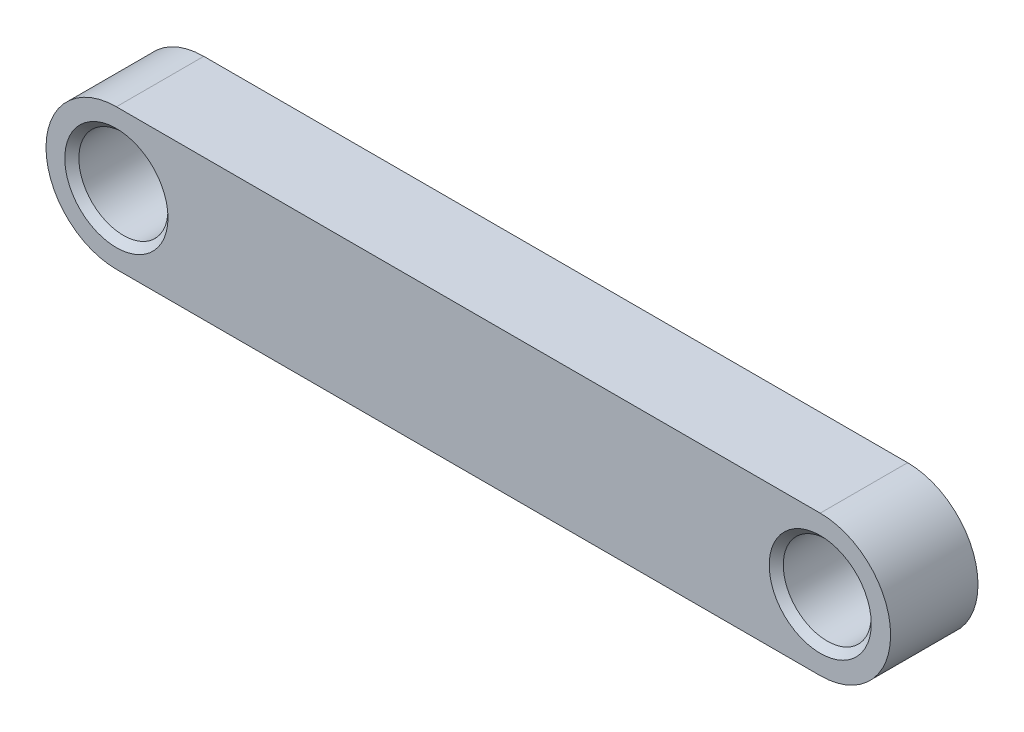
ISO-10303-21;
HEADER;
FILE_DESCRIPTION(('STEP AP214'),'2;1');
FILE_NAME('part.step','',(''),(''),'','','');
FILE_SCHEMA(('AUTOMOTIVE_DESIGN { 1 0 10303 214 1 1 1 1 }'));
ENDSEC;
DATA;
#1=APPLICATION_CONTEXT('core data for automotive mechanical design processes');
#2=APPLICATION_PROTOCOL_DEFINITION('international standard','automotive_design',2000,#1);
#3=PRODUCT_CONTEXT('',#1,'mechanical');
#4=PRODUCT('Part','Part','',(#3));
#5=PRODUCT_RELATED_PRODUCT_CATEGORY('part','',(#4));
#6=PRODUCT_DEFINITION_FORMATION('','',#4);
#7=PRODUCT_DEFINITION_CONTEXT('part definition',#1,'design');
#8=PRODUCT_DEFINITION('design','',#6,#7);
#9=PRODUCT_DEFINITION_SHAPE('','',#8);
#10=(LENGTH_UNIT() NAMED_UNIT(*) SI_UNIT(.MILLI.,.METRE.));
#11=(NAMED_UNIT(*) PLANE_ANGLE_UNIT() SI_UNIT($,.RADIAN.));
#12=(NAMED_UNIT(*) SI_UNIT($,.STERADIAN.) SOLID_ANGLE_UNIT());
#13=UNCERTAINTY_MEASURE_WITH_UNIT(LENGTH_MEASURE(1.E-05),#10,'distance_accuracy_value','');
#14=(GEOMETRIC_REPRESENTATION_CONTEXT(3) GLOBAL_UNCERTAINTY_ASSIGNED_CONTEXT((#13)) GLOBAL_UNIT_ASSIGNED_CONTEXT((#10,
#11,#12)) REPRESENTATION_CONTEXT('',''));
#15=CARTESIAN_POINT('',(0.,0.,0.));
#16=DIRECTION('',(0.,0.,1.));
#17=DIRECTION('',(1.,0.,0.));
#18=AXIS2_PLACEMENT_3D('',#15,#16,#17);
#19=CARTESIAN_POINT('',(-38.1,0.,9.4615));
#20=DIRECTION('',(0.,0.,-1.));
#21=DIRECTION('',(-1.,0.,0.));
#22=AXIS2_PLACEMENT_3D('',#19,#20,#21);
#23=CYLINDRICAL_SURFACE('',#22,7.62);
#24=CARTESIAN_POINT('',(-38.1,0.,0.));
#25=DIRECTION('',(0.,0.,1.));
#26=DIRECTION('',(1.,0.,0.));
#27=AXIS2_PLACEMENT_3D('',#24,#25,#26);
#28=CIRCLE('',#27,7.62);
#29=CARTESIAN_POINT('',(-38.1,7.62,0.));
#30=VERTEX_POINT('',#29);
#31=CARTESIAN_POINT('',(-38.1,-7.62,0.));
#32=VERTEX_POINT('',#31);
#33=EDGE_CURVE('E105',#30,#32,#28,.T.);
#34=ORIENTED_EDGE('',*,*,#33,.T.);
#35=DIRECTION('',(0.,0.,-1.));
#36=VECTOR('',#35,1.);
#37=CARTESIAN_POINT('',(-38.1,-7.62,9.4615));
#38=LINE('',#37,#36);
#39=CARTESIAN_POINT('',(-38.1,-7.62,9.4615));
#40=VERTEX_POINT('',#39);
#41=EDGE_CURVE('E96',#40,#32,#38,.T.);
#42=ORIENTED_EDGE('',*,*,#41,.F.);
#43=CARTESIAN_POINT('',(-38.1,0.,9.4615));
#44=DIRECTION('',(0.,0.,1.));
#45=DIRECTION('',(1.,0.,0.));
#46=AXIS2_PLACEMENT_3D('',#43,#44,#45);
#47=CIRCLE('',#46,7.62);
#48=CARTESIAN_POINT('',(-38.1,7.62,9.4615));
#49=VERTEX_POINT('',#48);
#50=EDGE_CURVE('E90',#49,#40,#47,.T.);
#51=ORIENTED_EDGE('',*,*,#50,.F.);
#52=DIRECTION('',(0.,0.,-1.));
#53=VECTOR('',#52,1.);
#54=CARTESIAN_POINT('',(-38.1,7.62,9.4615));
#55=LINE('',#54,#53);
#56=EDGE_CURVE('E101',#49,#30,#55,.T.);
#57=ORIENTED_EDGE('',*,*,#56,.T.);
#58=EDGE_LOOP('',(#34,#42,#51,#57));
#59=FACE_BOUND('',#58,.T.);
#60=ADVANCED_FACE('F37',(#59),#23,.T.);
#61=CARTESIAN_POINT('',(-38.1,-7.62,9.4615));
#62=DIRECTION('',(0.,1.,0.));
#63=DIRECTION('',(0.,0.,1.));
#64=AXIS2_PLACEMENT_3D('',#61,#62,#63);
#65=PLANE('',#64);
#66=DIRECTION('',(1.,0.,0.));
#67=VECTOR('',#66,1.);
#68=CARTESIAN_POINT('',(-38.1,-7.62,0.));
#69=LINE('',#68,#67);
#70=CARTESIAN_POINT('',(38.1,-7.62,0.));
#71=VERTEX_POINT('',#70);
#72=EDGE_CURVE('E95',#32,#71,#69,.T.);
#73=ORIENTED_EDGE('',*,*,#72,.T.);
#74=DIRECTION('',(0.,0.,-1.));
#75=VECTOR('',#74,1.);
#76=CARTESIAN_POINT('',(38.1,-7.62,9.4615));
#77=LINE('',#76,#75);
#78=CARTESIAN_POINT('',(38.1,-7.62,9.4615));
#79=VERTEX_POINT('',#78);
#80=EDGE_CURVE('E93',#79,#71,#77,.T.);
#81=ORIENTED_EDGE('',*,*,#80,.F.);
#82=DIRECTION('',(1.,0.,0.));
#83=VECTOR('',#82,1.);
#84=CARTESIAN_POINT('',(-38.1,-7.62,9.4615));
#85=LINE('',#84,#83);
#86=EDGE_CURVE('E85',#40,#79,#85,.T.);
#87=ORIENTED_EDGE('',*,*,#86,.F.);
#88=ORIENTED_EDGE('',*,*,#41,.T.);
#89=EDGE_LOOP('',(#73,#81,#87,#88));
#90=FACE_BOUND('',#89,.T.);
#91=ADVANCED_FACE('F94',(#90),#65,.F.);
#92=CARTESIAN_POINT('',(38.1,0.,9.4615));
#93=DIRECTION('',(0.,0.,-1.));
#94=DIRECTION('',(-1.,0.,0.));
#95=AXIS2_PLACEMENT_3D('',#92,#93,#94);
#96=CYLINDRICAL_SURFACE('',#95,7.62);
#97=CARTESIAN_POINT('',(38.1,0.,0.));
#98=DIRECTION('',(0.,0.,1.));
#99=DIRECTION('',(1.,0.,0.));
#100=AXIS2_PLACEMENT_3D('',#97,#98,#99);
#101=CIRCLE('',#100,7.62);
#102=CARTESIAN_POINT('',(38.1,7.62,0.));
#103=VERTEX_POINT('',#102);
#104=EDGE_CURVE('E71',#71,#103,#101,.T.);
#105=ORIENTED_EDGE('',*,*,#104,.T.);
#106=DIRECTION('',(0.,0.,-1.));
#107=VECTOR('',#106,1.);
#108=CARTESIAN_POINT('',(38.1,7.62,9.4615));
#109=LINE('',#108,#107);
#110=CARTESIAN_POINT('',(38.1,7.62,9.4615));
#111=VERTEX_POINT('',#110);
#112=EDGE_CURVE('E97',#111,#103,#109,.T.);
#113=ORIENTED_EDGE('',*,*,#112,.F.);
#114=CARTESIAN_POINT('',(38.1,0.,9.4615));
#115=DIRECTION('',(0.,0.,1.));
#116=DIRECTION('',(1.,0.,0.));
#117=AXIS2_PLACEMENT_3D('',#114,#115,#116);
#118=CIRCLE('',#117,7.62);
#119=EDGE_CURVE('E88',#79,#111,#118,.T.);
#120=ORIENTED_EDGE('',*,*,#119,.F.);
#121=ORIENTED_EDGE('',*,*,#80,.T.);
#122=EDGE_LOOP('',(#105,#113,#120,#121));
#123=FACE_BOUND('',#122,.T.);
#124=ADVANCED_FACE('F99',(#123),#96,.T.);
#125=CARTESIAN_POINT('',(-38.1,7.62,9.4615));
#126=DIRECTION('',(0.,-1.,0.));
#127=DIRECTION('',(0.,0.,-1.));
#128=AXIS2_PLACEMENT_3D('',#125,#126,#127);
#129=PLANE('',#128);
#130=DIRECTION('',(-1.,0.,0.));
#131=VECTOR('',#130,1.);
#132=CARTESIAN_POINT('',(-38.1,7.62,0.));
#133=LINE('',#132,#131);
#134=EDGE_CURVE('E77',#103,#30,#133,.T.);
#135=ORIENTED_EDGE('',*,*,#134,.T.);
#136=ORIENTED_EDGE('',*,*,#56,.F.);
#137=DIRECTION('',(-1.,0.,0.));
#138=VECTOR('',#137,1.);
#139=CARTESIAN_POINT('',(-38.1,7.62,9.4615));
#140=LINE('',#139,#138);
#141=EDGE_CURVE('E54',#111,#49,#140,.T.);
#142=ORIENTED_EDGE('',*,*,#141,.F.);
#143=ORIENTED_EDGE('',*,*,#112,.T.);
#144=EDGE_LOOP('',(#135,#136,#142,#143));
#145=FACE_BOUND('',#144,.T.);
#146=ADVANCED_FACE('F177',(#145),#129,.F.);
#147=CARTESIAN_POINT('',(-38.1,0.,9.4615));
#148=DIRECTION('',(0.,0.,1.));
#149=DIRECTION('',(1.,0.,0.));
#150=AXIS2_PLACEMENT_3D('',#147,#148,#149);
#151=PLANE('',#150);
#152=CARTESIAN_POINT('',(38.1,0.,9.4615));
#153=DIRECTION('',(0.,0.,1.));
#154=DIRECTION('',(1.,0.,0.));
#155=AXIS2_PLACEMENT_3D('',#152,#153,#154);
#156=CIRCLE('',#155,5.52450000000002);
#157=CARTESIAN_POINT('',(43.6245,0.,9.4615));
#158=VERTEX_POINT('',#157);
#159=EDGE_CURVE('E11',#158,#158,#156,.F.);
#160=ORIENTED_EDGE('',*,*,#159,.T.);
#161=EDGE_LOOP('',(#160));
#162=FACE_BOUND('',#161,.T.);
#163=CARTESIAN_POINT('',(-38.1,0.,9.4615));
#164=DIRECTION('',(0.,0.,1.));
#165=DIRECTION('',(1.,0.,0.));
#166=AXIS2_PLACEMENT_3D('',#163,#164,#165);
#167=CIRCLE('',#166,5.58800000000001);
#168=CARTESIAN_POINT('',(-32.512,0.,9.4615));
#169=VERTEX_POINT('',#168);
#170=EDGE_CURVE('E46',#169,#169,#167,.F.);
#171=ORIENTED_EDGE('',*,*,#170,.T.);
#172=EDGE_LOOP('',(#171));
#173=FACE_BOUND('',#172,.T.);
#174=ORIENTED_EDGE('',*,*,#50,.T.);
#175=ORIENTED_EDGE('',*,*,#86,.T.);
#176=ORIENTED_EDGE('',*,*,#119,.T.);
#177=ORIENTED_EDGE('',*,*,#141,.T.);
#178=EDGE_LOOP('',(#174,#175,#176,#177));
#179=FACE_BOUND('',#178,.T.);
#180=ADVANCED_FACE('F86',(#162,#173,#179),#151,.T.);
#181=CARTESIAN_POINT('',(-38.1,0.,0.));
#182=DIRECTION('',(0.,0.,1.));
#183=DIRECTION('',(1.,0.,0.));
#184=AXIS2_PLACEMENT_3D('',#181,#182,#183);
#185=PLANE('',#184);
#186=CARTESIAN_POINT('',(-38.1,0.,0.));
#187=DIRECTION('',(0.,0.,1.));
#188=DIRECTION('',(1.,0.,0.));
#189=AXIS2_PLACEMENT_3D('',#186,#187,#188);
#190=CIRCLE('',#189,5.58799999999998);
#191=CARTESIAN_POINT('',(-32.512,0.,0.));
#192=VERTEX_POINT('',#191);
#193=EDGE_CURVE('E117',#192,#192,#190,.T.);
#194=ORIENTED_EDGE('',*,*,#193,.T.);
#195=EDGE_LOOP('',(#194));
#196=FACE_BOUND('',#195,.T.);
#197=CARTESIAN_POINT('',(38.1,0.,0.));
#198=DIRECTION('',(0.,0.,1.));
#199=DIRECTION('',(1.,0.,0.));
#200=AXIS2_PLACEMENT_3D('',#197,#198,#199);
#201=CIRCLE('',#200,5.5245);
#202=CARTESIAN_POINT('',(43.6245,0.,0.));
#203=VERTEX_POINT('',#202);
#204=EDGE_CURVE('E114',#203,#203,#201,.T.);
#205=ORIENTED_EDGE('',*,*,#204,.T.);
#206=EDGE_LOOP('',(#205));
#207=FACE_BOUND('',#206,.T.);
#208=ORIENTED_EDGE('',*,*,#33,.F.);
#209=ORIENTED_EDGE('',*,*,#134,.F.);
#210=ORIENTED_EDGE('',*,*,#104,.F.);
#211=ORIENTED_EDGE('',*,*,#72,.F.);
#212=EDGE_LOOP('',(#208,#209,#210,#211));
#213=FACE_BOUND('',#212,.T.);
#214=ADVANCED_FACE('F153',(#196,#207,#213),#185,.F.);
#215=CARTESIAN_POINT('',(38.1,0.,0.));
#216=DIRECTION('',(0.,0.,1.));
#217=DIRECTION('',(1.,0.,0.));
#218=AXIS2_PLACEMENT_3D('',#215,#216,#217);
#219=CYLINDRICAL_SURFACE('',#218,4.7625);
#220=CARTESIAN_POINT('',(38.1,0.,0.761999999999994));
#221=DIRECTION('',(0.,0.,1.));
#222=DIRECTION('',(1.,0.,0.));
#223=AXIS2_PLACEMENT_3D('',#220,#221,#222);
#224=CIRCLE('',#223,4.7625);
#225=CARTESIAN_POINT('',(42.8625,0.,0.761999999999994));
#226=VERTEX_POINT('',#225);
#227=EDGE_CURVE('E129',#226,#226,#224,.F.);
#228=ORIENTED_EDGE('',*,*,#227,.T.);
#229=EDGE_LOOP('',(#228));
#230=FACE_BOUND('',#229,.T.);
#231=CARTESIAN_POINT('',(38.1,0.,8.69949999999999));
#232=DIRECTION('',(0.,0.,1.));
#233=DIRECTION('',(1.,0.,0.));
#234=AXIS2_PLACEMENT_3D('',#231,#232,#233);
#235=CIRCLE('',#234,4.7625);
#236=CARTESIAN_POINT('',(42.8625,0.,8.69949999999999));
#237=VERTEX_POINT('',#236);
#238=EDGE_CURVE('E126',#237,#237,#235,.T.);
#239=ORIENTED_EDGE('',*,*,#238,.T.);
#240=EDGE_LOOP('',(#239));
#241=FACE_BOUND('',#240,.T.);
#242=ADVANCED_FACE('F143',(#230,#241),#219,.F.);
#243=CARTESIAN_POINT('',(-38.1,0.,0.));
#244=DIRECTION('',(0.,0.,1.));
#245=DIRECTION('',(1.,0.,0.));
#246=AXIS2_PLACEMENT_3D('',#243,#244,#245);
#247=CYLINDRICAL_SURFACE('',#246,4.826);
#248=CARTESIAN_POINT('',(-38.1,0.,0.761999999999974));
#249=DIRECTION('',(0.,0.,1.));
#250=DIRECTION('',(1.,0.,0.));
#251=AXIS2_PLACEMENT_3D('',#248,#249,#250);
#252=CIRCLE('',#251,4.826);
#253=CARTESIAN_POINT('',(-33.274,0.,0.761999999999974));
#254=VERTEX_POINT('',#253);
#255=EDGE_CURVE('E123',#254,#254,#252,.F.);
#256=ORIENTED_EDGE('',*,*,#255,.T.);
#257=EDGE_LOOP('',(#256));
#258=FACE_BOUND('',#257,.T.);
#259=CARTESIAN_POINT('',(-38.1,0.,8.69949999999999));
#260=DIRECTION('',(0.,0.,1.));
#261=DIRECTION('',(1.,0.,0.));
#262=AXIS2_PLACEMENT_3D('',#259,#260,#261);
#263=CIRCLE('',#262,4.826);
#264=CARTESIAN_POINT('',(-33.274,0.,8.69949999999999));
#265=VERTEX_POINT('',#264);
#266=EDGE_CURVE('E120',#265,#265,#263,.T.);
#267=ORIENTED_EDGE('',*,*,#266,.T.);
#268=EDGE_LOOP('',(#267));
#269=FACE_BOUND('',#268,.T.);
#270=ADVANCED_FACE('F140',(#258,#269),#247,.F.);
#271=CARTESIAN_POINT('',(-38.1,0.,0.));
#272=DIRECTION('',(0.,0.,-1.));
#273=DIRECTION('',(-1.,0.,0.));
#274=AXIS2_PLACEMENT_3D('',#271,#272,#273);
#275=CONICAL_SURFACE('',#274,5.58799999999998,0.785398163397456);
#276=ORIENTED_EDGE('',*,*,#255,.F.);
#277=EDGE_LOOP('',(#276));
#278=FACE_BOUND('',#277,.T.);
#279=ORIENTED_EDGE('',*,*,#193,.F.);
#280=EDGE_LOOP('',(#279));
#281=FACE_BOUND('',#280,.T.);
#282=ADVANCED_FACE('F142',(#278,#281),#275,.F.);
#283=CARTESIAN_POINT('',(38.1,0.,0.));
#284=DIRECTION('',(0.,0.,-1.));
#285=DIRECTION('',(-1.,0.,0.));
#286=AXIS2_PLACEMENT_3D('',#283,#284,#285);
#287=CONICAL_SURFACE('',#286,5.5245,0.785398163397451);
#288=ORIENTED_EDGE('',*,*,#227,.F.);
#289=EDGE_LOOP('',(#288));
#290=FACE_BOUND('',#289,.T.);
#291=ORIENTED_EDGE('',*,*,#204,.F.);
#292=EDGE_LOOP('',(#291));
#293=FACE_BOUND('',#292,.T.);
#294=ADVANCED_FACE('F150',(#290,#293),#287,.F.);
#295=CARTESIAN_POINT('',(38.1,0.,8.69949999999999));
#296=DIRECTION('',(0.,0.,1.));
#297=DIRECTION('',(1.,0.,0.));
#298=AXIS2_PLACEMENT_3D('',#295,#296,#297);
#299=CONICAL_SURFACE('',#298,4.7625,0.785398163397449);
#300=ORIENTED_EDGE('',*,*,#159,.F.);
#301=EDGE_LOOP('',(#300));
#302=FACE_BOUND('',#301,.T.);
#303=ORIENTED_EDGE('',*,*,#238,.F.);
#304=EDGE_LOOP('',(#303));
#305=FACE_BOUND('',#304,.T.);
#306=ADVANCED_FACE('F137',(#302,#305),#299,.F.);
#307=CARTESIAN_POINT('',(-38.1,0.,8.69949999999999));
#308=DIRECTION('',(0.,0.,1.));
#309=DIRECTION('',(1.,0.,0.));
#310=AXIS2_PLACEMENT_3D('',#307,#308,#309);
#311=CONICAL_SURFACE('',#310,4.826,0.785398163397448);
#312=ORIENTED_EDGE('',*,*,#170,.F.);
#313=EDGE_LOOP('',(#312));
#314=FACE_BOUND('',#313,.T.);
#315=ORIENTED_EDGE('',*,*,#266,.F.);
#316=EDGE_LOOP('',(#315));
#317=FACE_BOUND('',#316,.T.);
#318=ADVANCED_FACE('F39',(#314,#317),#311,.F.);
#319=CLOSED_SHELL('',(#60,#91,#124,#146,#180,#214,#242,#270,#282,#294,#306,#318));
#320=MANIFOLD_SOLID_BREP('B2',#319);
#321=ADVANCED_BREP_SHAPE_REPRESENTATION('',(#18,#320),#14);
#322=SHAPE_DEFINITION_REPRESENTATION(#9,#321);
ENDSEC;
END-ISO-10303-21;
